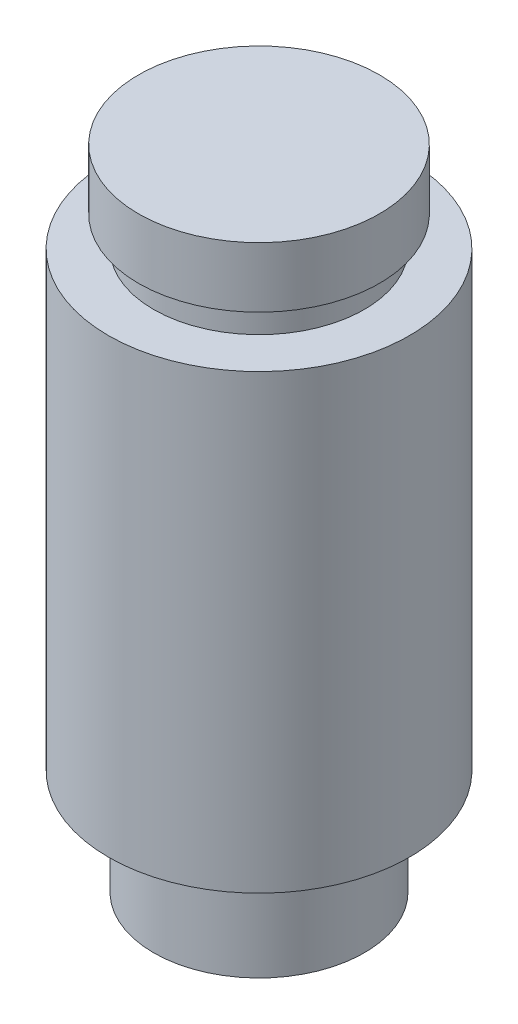
ISO-10303-21;
HEADER;
FILE_DESCRIPTION(('STEP AP214'),'2;1');
FILE_NAME('part.step','',(''),(''),'','','');
FILE_SCHEMA(('AUTOMOTIVE_DESIGN { 1 0 10303 214 1 1 1 1 }'));
ENDSEC;
DATA;
#1=APPLICATION_CONTEXT('core data for automotive mechanical design processes');
#2=APPLICATION_PROTOCOL_DEFINITION('international standard','automotive_design',2000,#1);
#3=PRODUCT_CONTEXT('',#1,'mechanical');
#4=PRODUCT('Part','Part','',(#3));
#5=PRODUCT_RELATED_PRODUCT_CATEGORY('part','',(#4));
#6=PRODUCT_DEFINITION_FORMATION('','',#4);
#7=PRODUCT_DEFINITION_CONTEXT('part definition',#1,'design');
#8=PRODUCT_DEFINITION('design','',#6,#7);
#9=PRODUCT_DEFINITION_SHAPE('','',#8);
#10=(LENGTH_UNIT() NAMED_UNIT(*) SI_UNIT(.MILLI.,.METRE.));
#11=(NAMED_UNIT(*) PLANE_ANGLE_UNIT() SI_UNIT($,.RADIAN.));
#12=(NAMED_UNIT(*) SI_UNIT($,.STERADIAN.) SOLID_ANGLE_UNIT());
#13=UNCERTAINTY_MEASURE_WITH_UNIT(LENGTH_MEASURE(1.E-05),#10,'distance_accuracy_value','');
#14=(GEOMETRIC_REPRESENTATION_CONTEXT(3) GLOBAL_UNCERTAINTY_ASSIGNED_CONTEXT((#13)) GLOBAL_UNIT_ASSIGNED_CONTEXT((#10,
#11,#12)) REPRESENTATION_CONTEXT('',''));
#15=CARTESIAN_POINT('',(0.,0.,0.));
#16=DIRECTION('',(0.,0.,1.));
#17=DIRECTION('',(1.,0.,0.));
#18=AXIS2_PLACEMENT_3D('',#15,#16,#17);
#19=CARTESIAN_POINT('',(8.89,0.,0.));
#20=DIRECTION('',(0.,-1.,0.));
#21=DIRECTION('',(0.,0.,-1.));
#22=AXIS2_PLACEMENT_3D('',#19,#20,#21);
#23=PLANE('',#22);
#24=CARTESIAN_POINT('',(0.,0.,0.));
#25=DIRECTION('',(0.,-1.,0.));
#26=DIRECTION('',(0.,0.,-1.));
#27=AXIS2_PLACEMENT_3D('',#24,#25,#26);
#28=CIRCLE('',#27,8.89);
#29=CARTESIAN_POINT('',(0.,0.,-8.89));
#30=VERTEX_POINT('',#29);
#31=EDGE_CURVE('E58',#30,#30,#28,.T.);
#32=ORIENTED_EDGE('',*,*,#31,.T.);
#33=EDGE_LOOP('',(#32));
#34=FACE_BOUND('',#33,.T.);
#35=ADVANCED_FACE('F30',(#34),#23,.T.);
#36=CARTESIAN_POINT('',(0.,54.61,0.));
#37=DIRECTION('',(0.,1.,0.));
#38=DIRECTION('',(0.,0.,1.));
#39=AXIS2_PLACEMENT_3D('',#36,#37,#38);
#40=PLANE('',#39);
#41=CARTESIAN_POINT('',(0.,54.61,0.));
#42=DIRECTION('',(0.,-1.,0.));
#43=DIRECTION('',(0.,0.,-1.));
#44=AXIS2_PLACEMENT_3D('',#41,#42,#43);
#45=CIRCLE('',#44,10.16);
#46=CARTESIAN_POINT('',(0.,54.61,-10.16));
#47=VERTEX_POINT('',#46);
#48=EDGE_CURVE('E10',#47,#47,#45,.T.);
#49=ORIENTED_EDGE('',*,*,#48,.F.);
#50=EDGE_LOOP('',(#49));
#51=FACE_BOUND('',#50,.T.);
#52=ADVANCED_FACE('F75',(#51),#40,.T.);
#53=CARTESIAN_POINT('',(0.,0.,0.));
#54=DIRECTION('',(0.,-1.,0.));
#55=DIRECTION('',(0.,0.,-1.));
#56=AXIS2_PLACEMENT_3D('',#53,#54,#55);
#57=CYLINDRICAL_SURFACE('',#56,10.16);
#58=ORIENTED_EDGE('',*,*,#48,.T.);
#59=EDGE_LOOP('',(#58));
#60=FACE_BOUND('',#59,.T.);
#61=CARTESIAN_POINT('',(0.,49.53,0.));
#62=DIRECTION('',(0.,-1.,0.));
#63=DIRECTION('',(0.,0.,-1.));
#64=AXIS2_PLACEMENT_3D('',#61,#62,#63);
#65=CIRCLE('',#64,10.16);
#66=CARTESIAN_POINT('',(0.,49.53,-10.16));
#67=VERTEX_POINT('',#66);
#68=EDGE_CURVE('E36',#67,#67,#65,.T.);
#69=ORIENTED_EDGE('',*,*,#68,.F.);
#70=EDGE_LOOP('',(#69));
#71=FACE_BOUND('',#70,.T.);
#72=ADVANCED_FACE('F79',(#60,#71),#57,.T.);
#73=CARTESIAN_POINT('',(10.16,49.53,0.));
#74=DIRECTION('',(0.,-1.,0.));
#75=DIRECTION('',(0.,0.,-1.));
#76=AXIS2_PLACEMENT_3D('',#73,#74,#75);
#77=PLANE('',#76);
#78=ORIENTED_EDGE('',*,*,#68,.T.);
#79=EDGE_LOOP('',(#78));
#80=FACE_BOUND('',#79,.T.);
#81=CARTESIAN_POINT('',(0.,49.53,0.));
#82=DIRECTION('',(0.,-1.,0.));
#83=DIRECTION('',(0.,0.,-1.));
#84=AXIS2_PLACEMENT_3D('',#81,#82,#83);
#85=CIRCLE('',#84,8.89);
#86=CARTESIAN_POINT('',(0.,49.53,-8.89));
#87=VERTEX_POINT('',#86);
#88=EDGE_CURVE('E40',#87,#87,#85,.T.);
#89=ORIENTED_EDGE('',*,*,#88,.F.);
#90=EDGE_LOOP('',(#89));
#91=FACE_BOUND('',#90,.T.);
#92=ADVANCED_FACE('F84',(#80,#91),#77,.T.);
#93=CARTESIAN_POINT('',(0.,0.,0.));
#94=DIRECTION('',(0.,-1.,0.));
#95=DIRECTION('',(0.,0.,-1.));
#96=AXIS2_PLACEMENT_3D('',#93,#94,#95);
#97=CYLINDRICAL_SURFACE('',#96,8.89);
#98=ORIENTED_EDGE('',*,*,#88,.T.);
#99=EDGE_LOOP('',(#98));
#100=FACE_BOUND('',#99,.T.);
#101=CARTESIAN_POINT('',(0.,46.99,0.));
#102=DIRECTION('',(0.,-1.,0.));
#103=DIRECTION('',(0.,0.,-1.));
#104=AXIS2_PLACEMENT_3D('',#101,#102,#103);
#105=CIRCLE('',#104,8.89);
#106=CARTESIAN_POINT('',(0.,46.99,-8.89));
#107=VERTEX_POINT('',#106);
#108=EDGE_CURVE('E44',#107,#107,#105,.T.);
#109=ORIENTED_EDGE('',*,*,#108,.F.);
#110=EDGE_LOOP('',(#109));
#111=FACE_BOUND('',#110,.T.);
#112=ADVANCED_FACE('F89',(#100,#111),#97,.T.);
#113=CARTESIAN_POINT('',(8.89,46.99,0.));
#114=DIRECTION('',(0.,1.,0.));
#115=DIRECTION('',(0.,0.,1.));
#116=AXIS2_PLACEMENT_3D('',#113,#114,#115);
#117=PLANE('',#116);
#118=ORIENTED_EDGE('',*,*,#108,.T.);
#119=EDGE_LOOP('',(#118));
#120=FACE_BOUND('',#119,.T.);
#121=CARTESIAN_POINT('',(0.,46.99,0.));
#122=DIRECTION('',(0.,-1.,0.));
#123=DIRECTION('',(0.,0.,-1.));
#124=AXIS2_PLACEMENT_3D('',#121,#122,#123);
#125=CIRCLE('',#124,12.7);
#126=CARTESIAN_POINT('',(0.,46.99,-12.7));
#127=VERTEX_POINT('',#126);
#128=EDGE_CURVE('E49',#127,#127,#125,.T.);
#129=ORIENTED_EDGE('',*,*,#128,.F.);
#130=EDGE_LOOP('',(#129));
#131=FACE_BOUND('',#130,.T.);
#132=ADVANCED_FACE('F92',(#120,#131),#117,.T.);
#133=CARTESIAN_POINT('',(0.,0.,0.));
#134=DIRECTION('',(0.,-1.,0.));
#135=DIRECTION('',(0.,0.,-1.));
#136=AXIS2_PLACEMENT_3D('',#133,#134,#135);
#137=CYLINDRICAL_SURFACE('',#136,12.7);
#138=ORIENTED_EDGE('',*,*,#128,.T.);
#139=EDGE_LOOP('',(#138));
#140=FACE_BOUND('',#139,.T.);
#141=CARTESIAN_POINT('',(0.,8.89,0.));
#142=DIRECTION('',(0.,-1.,0.));
#143=DIRECTION('',(0.,0.,-1.));
#144=AXIS2_PLACEMENT_3D('',#141,#142,#143);
#145=CIRCLE('',#144,12.7);
#146=CARTESIAN_POINT('',(0.,8.89,-12.7));
#147=VERTEX_POINT('',#146);
#148=EDGE_CURVE('E52',#147,#147,#145,.T.);
#149=ORIENTED_EDGE('',*,*,#148,.F.);
#150=EDGE_LOOP('',(#149));
#151=FACE_BOUND('',#150,.T.);
#152=ADVANCED_FACE('F71',(#140,#151),#137,.T.);
#153=CARTESIAN_POINT('',(12.7,8.89,0.));
#154=DIRECTION('',(0.,-1.,0.));
#155=DIRECTION('',(0.,0.,-1.));
#156=AXIS2_PLACEMENT_3D('',#153,#154,#155);
#157=PLANE('',#156);
#158=ORIENTED_EDGE('',*,*,#148,.T.);
#159=EDGE_LOOP('',(#158));
#160=FACE_BOUND('',#159,.T.);
#161=CARTESIAN_POINT('',(0.,8.89,0.));
#162=DIRECTION('',(0.,-1.,0.));
#163=DIRECTION('',(0.,0.,-1.));
#164=AXIS2_PLACEMENT_3D('',#161,#162,#163);
#165=CIRCLE('',#164,8.89);
#166=CARTESIAN_POINT('',(0.,8.89,-8.89));
#167=VERTEX_POINT('',#166);
#168=EDGE_CURVE('E55',#167,#167,#165,.T.);
#169=ORIENTED_EDGE('',*,*,#168,.F.);
#170=EDGE_LOOP('',(#169));
#171=FACE_BOUND('',#170,.T.);
#172=ADVANCED_FACE('F65',(#160,#171),#157,.T.);
#173=CARTESIAN_POINT('',(0.,0.,0.));
#174=DIRECTION('',(0.,-1.,0.));
#175=DIRECTION('',(0.,0.,-1.));
#176=AXIS2_PLACEMENT_3D('',#173,#174,#175);
#177=CYLINDRICAL_SURFACE('',#176,8.89);
#178=ORIENTED_EDGE('',*,*,#168,.T.);
#179=EDGE_LOOP('',(#178));
#180=FACE_BOUND('',#179,.T.);
#181=ORIENTED_EDGE('',*,*,#31,.F.);
#182=EDGE_LOOP('',(#181));
#183=FACE_BOUND('',#182,.T.);
#184=ADVANCED_FACE('F63',(#180,#183),#177,.T.);
#185=CLOSED_SHELL('',(#35,#52,#72,#92,#112,#132,#152,#172,#184));
#186=MANIFOLD_SOLID_BREP('B2',#185);
#187=ADVANCED_BREP_SHAPE_REPRESENTATION('',(#18,#186),#14);
#188=SHAPE_DEFINITION_REPRESENTATION(#9,#187);
ENDSEC;
END-ISO-10303-21;
